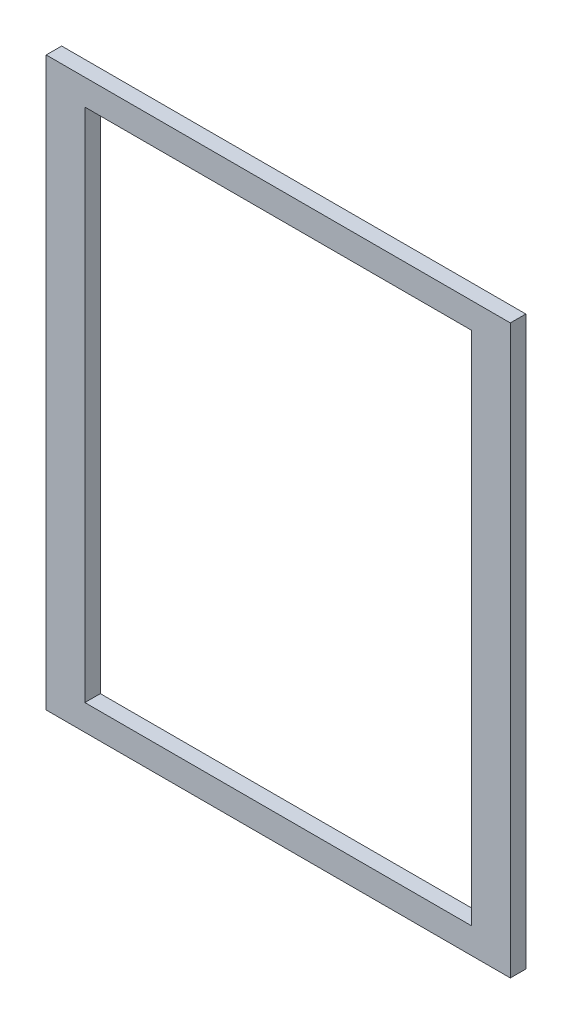
ISO-10303-21;
HEADER;
FILE_DESCRIPTION(('STEP AP214'),'2;1');
FILE_NAME('part.step','',(''),(''),'','','');
FILE_SCHEMA(('AUTOMOTIVE_DESIGN { 1 0 10303 214 1 1 1 1 }'));
ENDSEC;
DATA;
#1=APPLICATION_CONTEXT('core data for automotive mechanical design processes');
#2=APPLICATION_PROTOCOL_DEFINITION('international standard','automotive_design',2000,#1);
#3=PRODUCT_CONTEXT('',#1,'mechanical');
#4=PRODUCT('Part','Part','',(#3));
#5=PRODUCT_RELATED_PRODUCT_CATEGORY('part','',(#4));
#6=PRODUCT_DEFINITION_FORMATION('','',#4);
#7=PRODUCT_DEFINITION_CONTEXT('part definition',#1,'design');
#8=PRODUCT_DEFINITION('design','',#6,#7);
#9=PRODUCT_DEFINITION_SHAPE('','',#8);
#10=(LENGTH_UNIT() NAMED_UNIT(*) SI_UNIT(.MILLI.,.METRE.));
#11=(NAMED_UNIT(*) PLANE_ANGLE_UNIT() SI_UNIT($,.RADIAN.));
#12=(NAMED_UNIT(*) SI_UNIT($,.STERADIAN.) SOLID_ANGLE_UNIT());
#13=UNCERTAINTY_MEASURE_WITH_UNIT(LENGTH_MEASURE(1.E-05),#10,'distance_accuracy_value','');
#14=(GEOMETRIC_REPRESENTATION_CONTEXT(3) GLOBAL_UNCERTAINTY_ASSIGNED_CONTEXT((#13)) GLOBAL_UNIT_ASSIGNED_CONTEXT((#10,
#11,#12)) REPRESENTATION_CONTEXT('',''));
#15=CARTESIAN_POINT('',(0.,0.,0.));
#16=DIRECTION('',(0.,0.,1.));
#17=DIRECTION('',(1.,0.,0.));
#18=AXIS2_PLACEMENT_3D('',#15,#16,#17);
#19=CARTESIAN_POINT('',(0.,0.,6.));
#20=DIRECTION('',(0.,0.,1.));
#21=DIRECTION('',(1.,0.,0.));
#22=AXIS2_PLACEMENT_3D('',#19,#20,#21);
#23=PLANE('',#22);
#24=DIRECTION('',(0.,-1.,0.));
#25=VECTOR('',#24,1.);
#26=CARTESIAN_POINT('',(-90.,-110.,6.));
#27=LINE('',#26,#25);
#28=CARTESIAN_POINT('',(-90.,110.,6.));
#29=VERTEX_POINT('',#28);
#30=CARTESIAN_POINT('',(-90.,-110.,6.));
#31=VERTEX_POINT('',#30);
#32=EDGE_CURVE('E134',#29,#31,#27,.T.);
#33=ORIENTED_EDGE('',*,*,#32,.T.);
#34=DIRECTION('',(1.,0.,0.));
#35=VECTOR('',#34,1.);
#36=CARTESIAN_POINT('',(90.,-110.,6.));
#37=LINE('',#36,#35);
#38=CARTESIAN_POINT('',(90.,-110.,6.));
#39=VERTEX_POINT('',#38);
#40=EDGE_CURVE('E137',#31,#39,#37,.T.);
#41=ORIENTED_EDGE('',*,*,#40,.T.);
#42=DIRECTION('',(0.,1.,0.));
#43=VECTOR('',#42,1.);
#44=CARTESIAN_POINT('',(90.,-110.,6.));
#45=LINE('',#44,#43);
#46=CARTESIAN_POINT('',(90.,110.,6.));
#47=VERTEX_POINT('',#46);
#48=EDGE_CURVE('E140',#39,#47,#45,.T.);
#49=ORIENTED_EDGE('',*,*,#48,.T.);
#50=DIRECTION('',(-1.,0.,0.));
#51=VECTOR('',#50,1.);
#52=CARTESIAN_POINT('',(90.,110.,6.));
#53=LINE('',#52,#51);
#54=EDGE_CURVE('E142',#47,#29,#53,.T.);
#55=ORIENTED_EDGE('',*,*,#54,.T.);
#56=EDGE_LOOP('',(#33,#41,#49,#55));
#57=FACE_BOUND('',#56,.T.);
#58=DIRECTION('',(1.,0.,0.));
#59=VECTOR('',#58,1.);
#60=CARTESIAN_POINT('',(75.,-100.,6.));
#61=LINE('',#60,#59);
#62=CARTESIAN_POINT('',(-75.,-100.,6.));
#63=VERTEX_POINT('',#62);
#64=CARTESIAN_POINT('',(75.,-100.,6.));
#65=VERTEX_POINT('',#64);
#66=EDGE_CURVE('E106',#63,#65,#61,.T.);
#67=ORIENTED_EDGE('',*,*,#66,.F.);
#68=DIRECTION('',(0.,-1.,0.));
#69=VECTOR('',#68,1.);
#70=CARTESIAN_POINT('',(-75.,-100.,6.));
#71=LINE('',#70,#69);
#72=CARTESIAN_POINT('',(-75.,99.9999999999999,6.));
#73=VERTEX_POINT('',#72);
#74=EDGE_CURVE('E98',#73,#63,#71,.T.);
#75=ORIENTED_EDGE('',*,*,#74,.F.);
#76=DIRECTION('',(-1.,0.,0.));
#77=VECTOR('',#76,1.);
#78=CARTESIAN_POINT('',(75.,99.9999999999999,6.));
#79=LINE('',#78,#77);
#80=CARTESIAN_POINT('',(75.,99.9999999999999,6.));
#81=VERTEX_POINT('',#80);
#82=EDGE_CURVE('E120',#81,#73,#79,.T.);
#83=ORIENTED_EDGE('',*,*,#82,.F.);
#84=DIRECTION('',(0.,1.,0.));
#85=VECTOR('',#84,1.);
#86=CARTESIAN_POINT('',(75.,-100.,6.));
#87=LINE('',#86,#85);
#88=EDGE_CURVE('E118',#65,#81,#87,.T.);
#89=ORIENTED_EDGE('',*,*,#88,.F.);
#90=EDGE_LOOP('',(#67,#75,#83,#89));
#91=FACE_BOUND('',#90,.T.);
#92=ADVANCED_FACE('F33',(#57,#91),#23,.T.);
#93=CARTESIAN_POINT('',(0.,0.,0.));
#94=DIRECTION('',(0.,0.,1.));
#95=DIRECTION('',(1.,0.,0.));
#96=AXIS2_PLACEMENT_3D('',#93,#94,#95);
#97=PLANE('',#96);
#98=DIRECTION('',(0.,-1.,0.));
#99=VECTOR('',#98,1.);
#100=CARTESIAN_POINT('',(-90.,-110.,0.));
#101=LINE('',#100,#99);
#102=CARTESIAN_POINT('',(-90.,110.,0.));
#103=VERTEX_POINT('',#102);
#104=CARTESIAN_POINT('',(-90.,-110.,0.));
#105=VERTEX_POINT('',#104);
#106=EDGE_CURVE('E114',#103,#105,#101,.T.);
#107=ORIENTED_EDGE('',*,*,#106,.F.);
#108=DIRECTION('',(-1.,0.,0.));
#109=VECTOR('',#108,1.);
#110=CARTESIAN_POINT('',(90.,110.,0.));
#111=LINE('',#110,#109);
#112=CARTESIAN_POINT('',(90.,110.,0.));
#113=VERTEX_POINT('',#112);
#114=EDGE_CURVE('E138',#113,#103,#111,.T.);
#115=ORIENTED_EDGE('',*,*,#114,.F.);
#116=DIRECTION('',(0.,1.,0.));
#117=VECTOR('',#116,1.);
#118=CARTESIAN_POINT('',(90.,-110.,0.));
#119=LINE('',#118,#117);
#120=CARTESIAN_POINT('',(90.,-110.,0.));
#121=VERTEX_POINT('',#120);
#122=EDGE_CURVE('E149',#121,#113,#119,.T.);
#123=ORIENTED_EDGE('',*,*,#122,.F.);
#124=DIRECTION('',(1.,0.,0.));
#125=VECTOR('',#124,1.);
#126=CARTESIAN_POINT('',(90.,-110.,0.));
#127=LINE('',#126,#125);
#128=EDGE_CURVE('E147',#105,#121,#127,.T.);
#129=ORIENTED_EDGE('',*,*,#128,.F.);
#130=EDGE_LOOP('',(#107,#115,#123,#129));
#131=FACE_BOUND('',#130,.T.);
#132=DIRECTION('',(0.,-1.,0.));
#133=VECTOR('',#132,1.);
#134=CARTESIAN_POINT('',(-75.,-100.,0.));
#135=LINE('',#134,#133);
#136=CARTESIAN_POINT('',(-75.,99.9999999999999,0.));
#137=VERTEX_POINT('',#136);
#138=CARTESIAN_POINT('',(-75.,-100.,0.));
#139=VERTEX_POINT('',#138);
#140=EDGE_CURVE('E56',#137,#139,#135,.T.);
#141=ORIENTED_EDGE('',*,*,#140,.T.);
#142=DIRECTION('',(1.,0.,0.));
#143=VECTOR('',#142,1.);
#144=CARTESIAN_POINT('',(75.,-100.,0.));
#145=LINE('',#144,#143);
#146=CARTESIAN_POINT('',(75.,-100.,0.));
#147=VERTEX_POINT('',#146);
#148=EDGE_CURVE('E113',#139,#147,#145,.T.);
#149=ORIENTED_EDGE('',*,*,#148,.T.);
#150=DIRECTION('',(0.,1.,0.));
#151=VECTOR('',#150,1.);
#152=CARTESIAN_POINT('',(75.,-100.,0.));
#153=LINE('',#152,#151);
#154=CARTESIAN_POINT('',(75.,99.9999999999999,0.));
#155=VERTEX_POINT('',#154);
#156=EDGE_CURVE('E126',#147,#155,#153,.T.);
#157=ORIENTED_EDGE('',*,*,#156,.T.);
#158=DIRECTION('',(-1.,0.,0.));
#159=VECTOR('',#158,1.);
#160=CARTESIAN_POINT('',(75.,99.9999999999999,0.));
#161=LINE('',#160,#159);
#162=EDGE_CURVE('E107',#155,#137,#161,.T.);
#163=ORIENTED_EDGE('',*,*,#162,.T.);
#164=EDGE_LOOP('',(#141,#149,#157,#163));
#165=FACE_BOUND('',#164,.T.);
#166=ADVANCED_FACE('F167',(#131,#165),#97,.F.);
#167=CARTESIAN_POINT('',(-90.,-110.,6.));
#168=DIRECTION('',(1.,0.,0.));
#169=DIRECTION('',(0.,0.,-1.));
#170=AXIS2_PLACEMENT_3D('',#167,#168,#169);
#171=PLANE('',#170);
#172=ORIENTED_EDGE('',*,*,#106,.T.);
#173=DIRECTION('',(0.,0.,-1.));
#174=VECTOR('',#173,1.);
#175=CARTESIAN_POINT('',(-90.,-110.,6.));
#176=LINE('',#175,#174);
#177=EDGE_CURVE('E11',#31,#105,#176,.T.);
#178=ORIENTED_EDGE('',*,*,#177,.F.);
#179=ORIENTED_EDGE('',*,*,#32,.F.);
#180=DIRECTION('',(0.,0.,-1.));
#181=VECTOR('',#180,1.);
#182=CARTESIAN_POINT('',(-90.,110.,6.));
#183=LINE('',#182,#181);
#184=EDGE_CURVE('E144',#29,#103,#183,.T.);
#185=ORIENTED_EDGE('',*,*,#184,.T.);
#186=EDGE_LOOP('',(#172,#178,#179,#185));
#187=FACE_BOUND('',#186,.T.);
#188=ADVANCED_FACE('F35',(#187),#171,.F.);
#189=CARTESIAN_POINT('',(90.,-110.,6.));
#190=DIRECTION('',(0.,1.,0.));
#191=DIRECTION('',(0.,0.,1.));
#192=AXIS2_PLACEMENT_3D('',#189,#190,#191);
#193=PLANE('',#192);
#194=ORIENTED_EDGE('',*,*,#128,.T.);
#195=DIRECTION('',(0.,0.,-1.));
#196=VECTOR('',#195,1.);
#197=CARTESIAN_POINT('',(90.,-110.,6.));
#198=LINE('',#197,#196);
#199=EDGE_CURVE('E41',#39,#121,#198,.T.);
#200=ORIENTED_EDGE('',*,*,#199,.F.);
#201=ORIENTED_EDGE('',*,*,#40,.F.);
#202=ORIENTED_EDGE('',*,*,#177,.T.);
#203=EDGE_LOOP('',(#194,#200,#201,#202));
#204=FACE_BOUND('',#203,.T.);
#205=ADVANCED_FACE('F177',(#204),#193,.F.);
#206=CARTESIAN_POINT('',(90.,-110.,6.));
#207=DIRECTION('',(-1.,0.,0.));
#208=DIRECTION('',(0.,0.,1.));
#209=AXIS2_PLACEMENT_3D('',#206,#207,#208);
#210=PLANE('',#209);
#211=ORIENTED_EDGE('',*,*,#122,.T.);
#212=DIRECTION('',(0.,0.,-1.));
#213=VECTOR('',#212,1.);
#214=CARTESIAN_POINT('',(90.,110.,6.));
#215=LINE('',#214,#213);
#216=EDGE_CURVE('E154',#47,#113,#215,.T.);
#217=ORIENTED_EDGE('',*,*,#216,.F.);
#218=ORIENTED_EDGE('',*,*,#48,.F.);
#219=ORIENTED_EDGE('',*,*,#199,.T.);
#220=EDGE_LOOP('',(#211,#217,#218,#219));
#221=FACE_BOUND('',#220,.T.);
#222=ADVANCED_FACE('F161',(#221),#210,.F.);
#223=CARTESIAN_POINT('',(90.,110.,6.));
#224=DIRECTION('',(0.,-1.,0.));
#225=DIRECTION('',(0.,0.,-1.));
#226=AXIS2_PLACEMENT_3D('',#223,#224,#225);
#227=PLANE('',#226);
#228=ORIENTED_EDGE('',*,*,#114,.T.);
#229=ORIENTED_EDGE('',*,*,#184,.F.);
#230=ORIENTED_EDGE('',*,*,#54,.F.);
#231=ORIENTED_EDGE('',*,*,#216,.T.);
#232=EDGE_LOOP('',(#228,#229,#230,#231));
#233=FACE_BOUND('',#232,.T.);
#234=ADVANCED_FACE('F171',(#233),#227,.F.);
#235=CARTESIAN_POINT('',(-75.,-100.,6.));
#236=DIRECTION('',(1.,0.,0.));
#237=DIRECTION('',(0.,0.,-1.));
#238=AXIS2_PLACEMENT_3D('',#235,#236,#237);
#239=PLANE('',#238);
#240=ORIENTED_EDGE('',*,*,#140,.F.);
#241=DIRECTION('',(0.,0.,-1.));
#242=VECTOR('',#241,1.);
#243=CARTESIAN_POINT('',(-75.,99.9999999999999,6.));
#244=LINE('',#243,#242);
#245=EDGE_CURVE('E102',#73,#137,#244,.T.);
#246=ORIENTED_EDGE('',*,*,#245,.F.);
#247=ORIENTED_EDGE('',*,*,#74,.T.);
#248=DIRECTION('',(0.,0.,-1.));
#249=VECTOR('',#248,1.);
#250=CARTESIAN_POINT('',(-75.,-100.,6.));
#251=LINE('',#250,#249);
#252=EDGE_CURVE('E101',#63,#139,#251,.T.);
#253=ORIENTED_EDGE('',*,*,#252,.T.);
#254=EDGE_LOOP('',(#240,#246,#247,#253));
#255=FACE_BOUND('',#254,.T.);
#256=ADVANCED_FACE('F100',(#255),#239,.T.);
#257=CARTESIAN_POINT('',(75.,-100.,6.));
#258=DIRECTION('',(0.,1.,0.));
#259=DIRECTION('',(-1.,0.,0.));
#260=AXIS2_PLACEMENT_3D('',#257,#258,#259);
#261=PLANE('',#260);
#262=ORIENTED_EDGE('',*,*,#148,.F.);
#263=ORIENTED_EDGE('',*,*,#252,.F.);
#264=ORIENTED_EDGE('',*,*,#66,.T.);
#265=DIRECTION('',(0.,0.,-1.));
#266=VECTOR('',#265,1.);
#267=CARTESIAN_POINT('',(75.,-100.,6.));
#268=LINE('',#267,#266);
#269=EDGE_CURVE('E115',#65,#147,#268,.T.);
#270=ORIENTED_EDGE('',*,*,#269,.T.);
#271=EDGE_LOOP('',(#262,#263,#264,#270));
#272=FACE_BOUND('',#271,.T.);
#273=ADVANCED_FACE('F110',(#272),#261,.T.);
#274=CARTESIAN_POINT('',(75.,-100.,6.));
#275=DIRECTION('',(-1.,0.,0.));
#276=DIRECTION('',(0.,0.,1.));
#277=AXIS2_PLACEMENT_3D('',#274,#275,#276);
#278=PLANE('',#277);
#279=ORIENTED_EDGE('',*,*,#156,.F.);
#280=ORIENTED_EDGE('',*,*,#269,.F.);
#281=ORIENTED_EDGE('',*,*,#88,.T.);
#282=DIRECTION('',(0.,0.,-1.));
#283=VECTOR('',#282,1.);
#284=CARTESIAN_POINT('',(75.,99.9999999999999,6.));
#285=LINE('',#284,#283);
#286=EDGE_CURVE('E48',#81,#155,#285,.T.);
#287=ORIENTED_EDGE('',*,*,#286,.T.);
#288=EDGE_LOOP('',(#279,#280,#281,#287));
#289=FACE_BOUND('',#288,.T.);
#290=ADVANCED_FACE('F200',(#289),#278,.T.);
#291=CARTESIAN_POINT('',(75.,99.9999999999999,6.));
#292=DIRECTION('',(0.,-1.,0.));
#293=DIRECTION('',(1.,0.,0.));
#294=AXIS2_PLACEMENT_3D('',#291,#292,#293);
#295=PLANE('',#294);
#296=ORIENTED_EDGE('',*,*,#162,.F.);
#297=ORIENTED_EDGE('',*,*,#286,.F.);
#298=ORIENTED_EDGE('',*,*,#82,.T.);
#299=ORIENTED_EDGE('',*,*,#245,.T.);
#300=EDGE_LOOP('',(#296,#297,#298,#299));
#301=FACE_BOUND('',#300,.T.);
#302=ADVANCED_FACE('F204',(#301),#295,.T.);
#303=CLOSED_SHELL('',(#92,#166,#188,#205,#222,#234,#256,#273,#290,#302));
#304=MANIFOLD_SOLID_BREP('B2',#303);
#305=ADVANCED_BREP_SHAPE_REPRESENTATION('',(#18,#304),#14);
#306=SHAPE_DEFINITION_REPRESENTATION(#9,#305);
ENDSEC;
END-ISO-10303-21;
